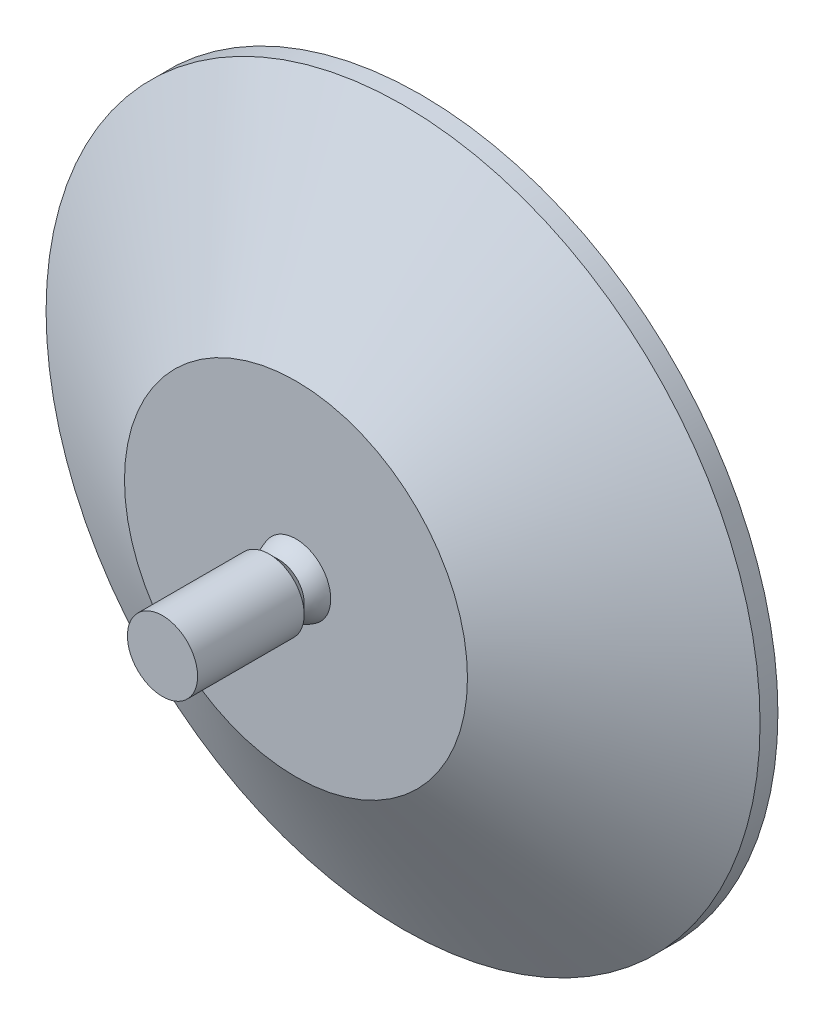
ISO-10303-21;
HEADER;
FILE_DESCRIPTION(('STEP AP214'),'2;1');
FILE_NAME('part.step','',(''),(''),'','','');
FILE_SCHEMA(('AUTOMOTIVE_DESIGN { 1 0 10303 214 1 1 1 1 }'));
ENDSEC;
DATA;
#1=APPLICATION_CONTEXT('core data for automotive mechanical design processes');
#2=APPLICATION_PROTOCOL_DEFINITION('international standard','automotive_design',2000,#1);
#3=PRODUCT_CONTEXT('',#1,'mechanical');
#4=PRODUCT('Part','Part','',(#3));
#5=PRODUCT_RELATED_PRODUCT_CATEGORY('part','',(#4));
#6=PRODUCT_DEFINITION_FORMATION('','',#4);
#7=PRODUCT_DEFINITION_CONTEXT('part definition',#1,'design');
#8=PRODUCT_DEFINITION('design','',#6,#7);
#9=PRODUCT_DEFINITION_SHAPE('','',#8);
#10=(LENGTH_UNIT() NAMED_UNIT(*) SI_UNIT(.MILLI.,.METRE.));
#11=(NAMED_UNIT(*) PLANE_ANGLE_UNIT() SI_UNIT($,.RADIAN.));
#12=(NAMED_UNIT(*) SI_UNIT($,.STERADIAN.) SOLID_ANGLE_UNIT());
#13=UNCERTAINTY_MEASURE_WITH_UNIT(LENGTH_MEASURE(1.E-05),#10,'distance_accuracy_value','');
#14=(GEOMETRIC_REPRESENTATION_CONTEXT(3) GLOBAL_UNCERTAINTY_ASSIGNED_CONTEXT((#13)) GLOBAL_UNIT_ASSIGNED_CONTEXT((#10,
#11,#12)) REPRESENTATION_CONTEXT('',''));
#15=CARTESIAN_POINT('',(0.,0.,0.));
#16=DIRECTION('',(0.,0.,1.));
#17=DIRECTION('',(1.,0.,0.));
#18=AXIS2_PLACEMENT_3D('',#15,#16,#17);
#19=CARTESIAN_POINT('',(0.,0.,2.));
#20=DIRECTION('',(0.,0.,-1.));
#21=DIRECTION('',(-1.,0.,0.));
#22=AXIS2_PLACEMENT_3D('',#19,#20,#21);
#23=CYLINDRICAL_SURFACE('',#22,40.);
#24=CARTESIAN_POINT('',(0.,0.,2.));
#25=DIRECTION('',(0.,0.,1.));
#26=DIRECTION('',(1.,0.,0.));
#27=AXIS2_PLACEMENT_3D('',#24,#25,#26);
#28=CIRCLE('',#27,40.);
#29=CARTESIAN_POINT('',(40.,0.,2.));
#30=VERTEX_POINT('',#29);
#31=EDGE_CURVE('E41',#30,#30,#28,.T.);
#32=ORIENTED_EDGE('',*,*,#31,.F.);
#33=EDGE_LOOP('',(#32));
#34=FACE_BOUND('',#33,.T.);
#35=CARTESIAN_POINT('',(0.,0.,0.));
#36=DIRECTION('',(0.,0.,1.));
#37=DIRECTION('',(1.,0.,0.));
#38=AXIS2_PLACEMENT_3D('',#35,#36,#37);
#39=CIRCLE('',#38,40.);
#40=CARTESIAN_POINT('',(40.,0.,0.));
#41=VERTEX_POINT('',#40);
#42=EDGE_CURVE('E45',#41,#41,#39,.T.);
#43=ORIENTED_EDGE('',*,*,#42,.T.);
#44=EDGE_LOOP('',(#43));
#45=FACE_BOUND('',#44,.T.);
#46=ADVANCED_FACE('F35',(#34,#45),#23,.T.);
#47=CARTESIAN_POINT('',(0.,0.,0.));
#48=DIRECTION('',(0.,0.,1.));
#49=DIRECTION('',(1.,0.,0.));
#50=AXIS2_PLACEMENT_3D('',#47,#48,#49);
#51=PLANE('',#50);
#52=ORIENTED_EDGE('',*,*,#42,.F.);
#53=EDGE_LOOP('',(#52));
#54=FACE_BOUND('',#53,.T.);
#55=ADVANCED_FACE('F83',(#54),#51,.F.);
#56=CARTESIAN_POINT('',(0.,0.,2.));
#57=DIRECTION('',(0.,0.,-1.));
#58=DIRECTION('',(1.,0.,0.));
#59=AXIS2_PLACEMENT_3D('',#56,#57,#58);
#60=CONICAL_SURFACE('',#59,40.,1.0471975511966);
#61=CARTESIAN_POINT('',(0.,0.,14.));
#62=DIRECTION('',(0.,0.,1.));
#63=DIRECTION('',(1.,0.,0.));
#64=AXIS2_PLACEMENT_3D('',#61,#62,#63);
#65=CIRCLE('',#64,19.2153903091734);
#66=CARTESIAN_POINT('',(19.2153903091734,0.,14.));
#67=VERTEX_POINT('',#66);
#68=EDGE_CURVE('E50',#67,#67,#65,.T.);
#69=ORIENTED_EDGE('',*,*,#68,.F.);
#70=EDGE_LOOP('',(#69));
#71=FACE_BOUND('',#70,.T.);
#72=ORIENTED_EDGE('',*,*,#31,.T.);
#73=EDGE_LOOP('',(#72));
#74=FACE_BOUND('',#73,.T.);
#75=ADVANCED_FACE('F79',(#71,#74),#60,.T.);
#76=CARTESIAN_POINT('',(0.,0.,14.));
#77=DIRECTION('',(0.,0.,1.));
#78=DIRECTION('',(1.,0.,0.));
#79=AXIS2_PLACEMENT_3D('',#76,#77,#78);
#80=PLANE('',#79);
#81=CARTESIAN_POINT('',(0.,0.,14.));
#82=DIRECTION('',(0.,0.,1.));
#83=DIRECTION('',(1.,0.,0.));
#84=AXIS2_PLACEMENT_3D('',#81,#82,#83);
#85=CIRCLE('',#84,3.89249573236021);
#86=CARTESIAN_POINT('',(3.89249573236021,0.,14.));
#87=VERTEX_POINT('',#86);
#88=EDGE_CURVE('E10',#87,#87,#85,.T.);
#89=ORIENTED_EDGE('',*,*,#88,.F.);
#90=EDGE_LOOP('',(#89));
#91=FACE_BOUND('',#90,.T.);
#92=ORIENTED_EDGE('',*,*,#68,.T.);
#93=EDGE_LOOP('',(#92));
#94=FACE_BOUND('',#93,.T.);
#95=ADVANCED_FACE('F70',(#91,#94),#80,.T.);
#96=CARTESIAN_POINT('',(0.,0.,13.0788719016567));
#97=DIRECTION('',(0.,0.,1.));
#98=DIRECTION('',(1.,0.,0.));
#99=AXIS2_PLACEMENT_3D('',#96,#97,#98);
#100=SPHERICAL_SURFACE('',#99,4.);
#101=ORIENTED_EDGE('',*,*,#88,.T.);
#102=EDGE_LOOP('',(#101));
#103=FACE_BOUND('',#102,.T.);
#104=CARTESIAN_POINT('',(0.,0.,15.9072990264029));
#105=DIRECTION('',(0.,0.,1.));
#106=DIRECTION('',(1.,0.,0.));
#107=AXIS2_PLACEMENT_3D('',#104,#105,#106);
#108=CIRCLE('',#107,2.82842712474624);
#109=CARTESIAN_POINT('',(2.82842712474622,0.,15.9072990264029));
#110=VERTEX_POINT('',#109);
#111=EDGE_CURVE('E60',#110,#110,#108,.T.);
#112=ORIENTED_EDGE('',*,*,#111,.F.);
#113=EDGE_LOOP('',(#112));
#114=FACE_BOUND('',#113,.T.);
#115=ADVANCED_FACE('F67',(#103,#114),#100,.T.);
#116=CARTESIAN_POINT('',(3.93204133475612,0.,28.9557608525079));
#117=DIRECTION('',(0.,0.,1.));
#118=DIRECTION('',(1.,0.,0.));
#119=AXIS2_PLACEMENT_3D('',#116,#117,#118);
#120=PLANE('',#119);
#121=CARTESIAN_POINT('',(0.,0.,28.9557608525079));
#122=DIRECTION('',(0.,0.,1.));
#123=DIRECTION('',(1.,0.,0.));
#124=AXIS2_PLACEMENT_3D('',#121,#122,#123);
#125=CIRCLE('',#124,3.93204133475614);
#126=CARTESIAN_POINT('',(3.93204133475612,0.,28.9557608525079));
#127=VERTEX_POINT('',#126);
#128=EDGE_CURVE('E54',#127,#127,#125,.T.);
#129=ORIENTED_EDGE('',*,*,#128,.T.);
#130=EDGE_LOOP('',(#129));
#131=FACE_BOUND('',#130,.T.);
#132=ADVANCED_FACE('F69',(#131),#120,.T.);
#133=CARTESIAN_POINT('',(0.,0.,28.9557608525079));
#134=DIRECTION('',(0.,0.,1.));
#135=DIRECTION('',(1.,0.,0.));
#136=AXIS2_PLACEMENT_3D('',#133,#134,#135);
#137=CYLINDRICAL_SURFACE('',#136,3.93204133475614);
#138=CARTESIAN_POINT('',(0.,0.,17.0109132364127));
#139=DIRECTION('',(0.,0.,1.));
#140=DIRECTION('',(1.,0.,0.));
#141=AXIS2_PLACEMENT_3D('',#138,#139,#140);
#142=CIRCLE('',#141,3.93204133475614);
#143=CARTESIAN_POINT('',(3.93204133475612,0.,17.0109132364127));
#144=VERTEX_POINT('',#143);
#145=EDGE_CURVE('E57',#144,#144,#142,.T.);
#146=ORIENTED_EDGE('',*,*,#145,.T.);
#147=EDGE_LOOP('',(#146));
#148=FACE_BOUND('',#147,.T.);
#149=ORIENTED_EDGE('',*,*,#128,.F.);
#150=EDGE_LOOP('',(#149));
#151=FACE_BOUND('',#150,.T.);
#152=ADVANCED_FACE('F76',(#148,#151),#137,.T.);
#153=CARTESIAN_POINT('',(0.,0.,17.0109132364127));
#154=DIRECTION('',(0.,0.,1.));
#155=DIRECTION('',(1.,0.,0.));
#156=AXIS2_PLACEMENT_3D('',#153,#154,#155);
#157=CONICAL_SURFACE('',#156,3.93204133475614,0.78539816339746);
#158=ORIENTED_EDGE('',*,*,#111,.T.);
#159=EDGE_LOOP('',(#158));
#160=FACE_BOUND('',#159,.T.);
#161=ORIENTED_EDGE('',*,*,#145,.F.);
#162=EDGE_LOOP('',(#161));
#163=FACE_BOUND('',#162,.T.);
#164=ADVANCED_FACE('F64',(#160,#163),#157,.T.);
#165=CLOSED_SHELL('',(#46,#55,#75,#95,#115,#132,#152,#164));
#166=MANIFOLD_SOLID_BREP('B2',#165);
#167=ADVANCED_BREP_SHAPE_REPRESENTATION('',(#18,#166),#14);
#168=SHAPE_DEFINITION_REPRESENTATION(#9,#167);
ENDSEC;
END-ISO-10303-21;
